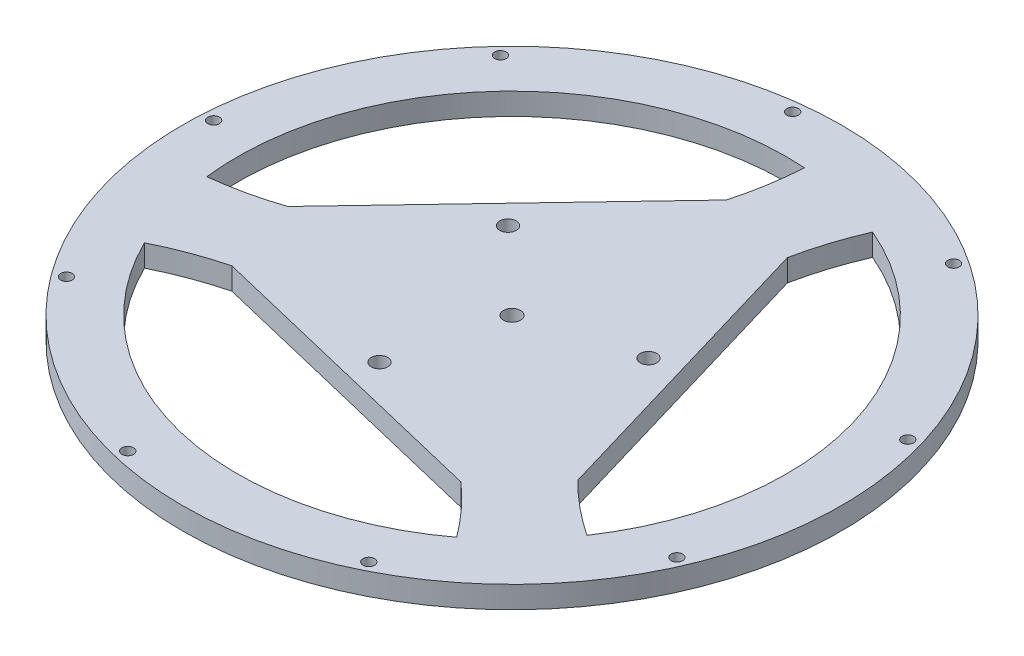
ISO-10303-21;
HEADER;
FILE_DESCRIPTION(('STEP AP214'),'2;1');
FILE_NAME('part.step','',(''),(''),'','','');
FILE_SCHEMA(('AUTOMOTIVE_DESIGN { 1 0 10303 214 1 1 1 1 }'));
ENDSEC;
DATA;
#1=APPLICATION_CONTEXT('core data for automotive mechanical design processes');
#2=APPLICATION_PROTOCOL_DEFINITION('international standard','automotive_design',2000,#1);
#3=PRODUCT_CONTEXT('',#1,'mechanical');
#4=PRODUCT('Part','Part','',(#3));
#5=PRODUCT_RELATED_PRODUCT_CATEGORY('part','',(#4));
#6=PRODUCT_DEFINITION_FORMATION('','',#4);
#7=PRODUCT_DEFINITION_CONTEXT('part definition',#1,'design');
#8=PRODUCT_DEFINITION('design','',#6,#7);
#9=PRODUCT_DEFINITION_SHAPE('','',#8);
#10=(LENGTH_UNIT() NAMED_UNIT(*) SI_UNIT(.MILLI.,.METRE.));
#11=(NAMED_UNIT(*) PLANE_ANGLE_UNIT() SI_UNIT($,.RADIAN.));
#12=(NAMED_UNIT(*) SI_UNIT($,.STERADIAN.) SOLID_ANGLE_UNIT());
#13=UNCERTAINTY_MEASURE_WITH_UNIT(LENGTH_MEASURE(1.E-05),#10,'distance_accuracy_value','');
#14=(GEOMETRIC_REPRESENTATION_CONTEXT(3) GLOBAL_UNCERTAINTY_ASSIGNED_CONTEXT((#13)) GLOBAL_UNIT_ASSIGNED_CONTEXT((#10,
#11,#12)) REPRESENTATION_CONTEXT('',''));
#15=CARTESIAN_POINT('',(0.,0.,0.));
#16=DIRECTION('',(0.,0.,1.));
#17=DIRECTION('',(1.,0.,0.));
#18=AXIS2_PLACEMENT_3D('',#15,#16,#17);
#19=CARTESIAN_POINT('',(0.,4.,0.));
#20=DIRECTION('',(0.,1.,0.));
#21=DIRECTION('',(0.,0.,1.));
#22=AXIS2_PLACEMENT_3D('',#19,#20,#21);
#23=PLANE('',#22);
#24=CARTESIAN_POINT('',(-57.8899742574897,4.,-3.5708375022087));
#25=DIRECTION('',(0.,1.,0.));
#26=DIRECTION('',(0.,0.,1.));
#27=AXIS2_PLACEMENT_3D('',#24,#25,#26);
#28=CIRCLE('',#27,1.05293502772648);
#29=CARTESIAN_POINT('',(-57.8899742574897,4.,-2.51790247448222));
#30=VERTEX_POINT('',#29);
#31=EDGE_CURVE('E468',#30,#30,#28,.F.);
#32=ORIENTED_EDGE('',*,*,#31,.T.);
#33=EDGE_LOOP('',(#32));
#34=FACE_BOUND('',#33,.T.);
#35=CARTESIAN_POINT('',(0.,4.,0.));
#36=DIRECTION('',(0.,1.,0.));
#37=DIRECTION('',(0.,0.,1.));
#38=AXIS2_PLACEMENT_3D('',#35,#36,#37);
#39=CIRCLE('',#38,1.55);
#40=CARTESIAN_POINT('',(0.,4.,1.55));
#41=VERTEX_POINT('',#40);
#42=EDGE_CURVE('E302',#41,#41,#39,.F.);
#43=ORIENTED_EDGE('',*,*,#42,.T.);
#44=EDGE_LOOP('',(#43));
#45=FACE_BOUND('',#44,.T.);
#46=CARTESIAN_POINT('',(53.1774832729495,4.,23.1550269435159));
#47=DIRECTION('',(0.,1.,0.));
#48=DIRECTION('',(0.,0.,1.));
#49=AXIS2_PLACEMENT_3D('',#46,#47,#48);
#50=CIRCLE('',#49,1.05293502772553);
#51=CARTESIAN_POINT('',(53.1774832729495,4.,24.2079619712414));
#52=VERTEX_POINT('',#51);
#53=EDGE_CURVE('E312',#52,#52,#50,.T.);
#54=ORIENTED_EDGE('',*,*,#53,.F.);
#55=EDGE_LOOP('',(#54));
#56=FACE_BOUND('',#55,.T.);
#57=CARTESIAN_POINT('',(-13.5690769919208,4.,56.3904260454485));
#58=DIRECTION('',(0.,1.,0.));
#59=DIRECTION('',(0.,0.,1.));
#60=AXIS2_PLACEMENT_3D('',#57,#58,#59);
#61=CIRCLE('',#60,1.05293502772525);
#62=CARTESIAN_POINT('',(-13.5690769919208,4.,57.4433610731738));
#63=VERTEX_POINT('',#62);
#64=EDGE_CURVE('E324',#63,#63,#61,.T.);
#65=ORIENTED_EDGE('',*,*,#64,.F.);
#66=EDGE_LOOP('',(#65));
#67=FACE_BOUND('',#66,.T.);
#68=CARTESIAN_POINT('',(-6.53590007807735,4.,-57.6305648954562));
#69=DIRECTION('',(0.,1.,0.));
#70=DIRECTION('',(0.,0.,1.));
#71=AXIS2_PLACEMENT_3D('',#68,#69,#70);
#72=CIRCLE('',#71,1.05293502772648);
#73=CARTESIAN_POINT('',(-6.53590007807735,4.,-56.5776298677297));
#74=VERTEX_POINT('',#73);
#75=EDGE_CURVE('E336',#74,#74,#72,.T.);
#76=ORIENTED_EDGE('',*,*,#75,.F.);
#77=EDGE_LOOP('',(#76));
#78=FACE_BOUND('',#77,.T.);
#79=CARTESIAN_POINT('',(55.6200799815454,4.,-16.4440476418153));
#80=DIRECTION('',(0.,1.,0.));
#81=DIRECTION('',(0.,0.,1.));
#82=AXIS2_PLACEMENT_3D('',#79,#80,#81);
#83=CIRCLE('',#82,1.05293502772614);
#84=CARTESIAN_POINT('',(55.6200799815454,4.,-15.3911126140892));
#85=VERTEX_POINT('',#84);
#86=EDGE_CURVE('E348',#85,#85,#83,.T.);
#87=ORIENTED_EDGE('',*,*,#86,.F.);
#88=EDGE_LOOP('',(#87));
#89=FACE_BOUND('',#88,.T.);
#90=CARTESIAN_POINT('',(-4.67899206617935,4.,19.444974498431));
#91=DIRECTION('',(0.,1.,0.));
#92=DIRECTION('',(0.,0.,1.));
#93=AXIS2_PLACEMENT_3D('',#90,#91,#92);
#94=CIRCLE('',#93,1.5);
#95=CARTESIAN_POINT('',(-4.67899206617935,4.,20.944974498431));
#96=VERTEX_POINT('',#95);
#97=EDGE_CURVE('E360',#96,#96,#94,.T.);
#98=ORIENTED_EDGE('',*,*,#97,.F.);
#99=EDGE_LOOP('',(#98));
#100=FACE_BOUND('',#99,.T.);
#101=CARTESIAN_POINT('',(0.,4.,0.));
#102=DIRECTION('',(0.,1.,0.));
#103=DIRECTION('',(0.,0.,1.));
#104=AXIS2_PLACEMENT_3D('',#101,#102,#103);
#105=CIRCLE('',#104,50.);
#106=CARTESIAN_POINT('',(41.5155711519758,4.,27.8649843338415));
#107=VERTEX_POINT('',#106);
#108=CARTESIAN_POINT('',(19.6892098874326,4.,-45.9601459311067));
#109=VERTEX_POINT('',#108);
#110=EDGE_CURVE('E406',#107,#109,#105,.T.);
#111=ORIENTED_EDGE('',*,*,#110,.F.);
#112=CARTESIAN_POINT('',(74.7395128137497,4.,-22.0966979882647));
#113=DIRECTION('',(0.,1.,0.));
#114=DIRECTION('',(0.,0.,1.));
#115=AXIS2_PLACEMENT_3D('',#112,#113,#114);
#116=CIRCLE('',#115,60.);
#117=CARTESIAN_POINT('',(31.9813255757251,4.,19.995313416728));
#118=VERTEX_POINT('',#117);
#119=EDGE_CURVE('E404',#118,#107,#116,.T.);
#120=ORIENTED_EDGE('',*,*,#119,.F.);
#121=DIRECTION('',(-0.28351806278993,0.,-0.958966896233569));
#122=VECTOR('',#121,1.);
#123=CARTESIAN_POINT('',(31.9813255757251,4.,19.995313416728));
#124=LINE('',#123,#122);
#125=CARTESIAN_POINT('',(15.967019235954,4.,-34.1712165562232));
#126=VERTEX_POINT('',#125);
#127=EDGE_CURVE('E412',#118,#126,#124,.T.);
#128=ORIENTED_EDGE('',*,*,#127,.T.);
#129=CARTESIAN_POINT('',(74.7395128137497,4.,-22.0966979882647));
#130=DIRECTION('',(0.,1.,0.));
#131=DIRECTION('',(0.,0.,1.));
#132=AXIS2_PLACEMENT_3D('',#129,#130,#131);
#133=CIRCLE('',#132,60.);
#134=EDGE_CURVE('E409',#109,#126,#133,.T.);
#135=ORIENTED_EDGE('',*,*,#134,.F.);
#136=EDGE_LOOP('',(#111,#120,#128,#135));
#137=FACE_BOUND('',#136,.T.);
#138=CARTESIAN_POINT('',(-14.5003458584922,4.,-13.7746132426325));
#139=DIRECTION('',(0.,1.,0.));
#140=DIRECTION('',(0.,0.,1.));
#141=AXIS2_PLACEMENT_3D('',#138,#139,#140);
#142=CIRCLE('',#141,1.5);
#143=CARTESIAN_POINT('',(-14.5003458584922,4.,-12.2746132426325));
#144=VERTEX_POINT('',#143);
#145=EDGE_CURVE('E436',#144,#144,#142,.T.);
#146=ORIENTED_EDGE('',*,*,#145,.F.);
#147=EDGE_LOOP('',(#146));
#148=FACE_BOUND('',#147,.T.);
#149=CARTESIAN_POINT('',(0.,4.,0.));
#150=DIRECTION('',(0.,1.,0.));
#151=DIRECTION('',(0.,0.,1.));
#152=AXIS2_PLACEMENT_3D('',#149,#150,#151);
#153=CIRCLE('',#152,60.);
#154=CARTESIAN_POINT('',(0.,4.,60.));
#155=VERTEX_POINT('',#154);
#156=EDGE_CURVE('E12',#155,#155,#153,.T.);
#157=ORIENTED_EDGE('',*,*,#156,.T.);
#158=EDGE_LOOP('',(#157));
#159=FACE_BOUND('',#158,.T.);
#160=CARTESIAN_POINT('',(-42.0510029896274,4.,-39.9463784036344));
#161=DIRECTION('',(0.,1.,0.));
#162=DIRECTION('',(0.,0.,1.));
#163=AXIS2_PLACEMENT_3D('',#160,#161,#162);
#164=CIRCLE('',#163,1.05293502772648);
#165=CARTESIAN_POINT('',(-42.0510029896274,4.,-38.8934433759079));
#166=VERTEX_POINT('',#165);
#167=EDGE_CURVE('E398',#166,#166,#164,.T.);
#168=ORIENTED_EDGE('',*,*,#167,.F.);
#169=EDGE_LOOP('',(#168));
#170=FACE_BOUND('',#169,.T.);
#171=CARTESIAN_POINT('',(0.,4.,0.));
#172=DIRECTION('',(0.,1.,0.));
#173=DIRECTION('',(0.,0.,1.));
#174=AXIS2_PLACEMENT_3D('',#171,#172,#173);
#175=CIRCLE('',#174,50.);
#176=CARTESIAN_POINT('',(-44.8895698851501,4.,22.0210471033105));
#177=VERTEX_POINT('',#176);
#178=CARTESIAN_POINT('',(29.9580489942619,4.,40.0314289085139));
#179=VERTEX_POINT('',#178);
#180=EDGE_CURVE('E368',#177,#179,#175,.T.);
#181=ORIENTED_EDGE('',*,*,#180,.F.);
#182=CARTESIAN_POINT('',(-18.2334546092855,4.,75.774665757312));
#183=DIRECTION('',(0.,1.,0.));
#184=DIRECTION('',(0.,0.,1.));
#185=AXIS2_PLACEMENT_3D('',#182,#183,#184);
#186=CIRCLE('',#185,60.);
#187=CARTESIAN_POINT('',(-33.3071121633809,4.,17.6989836869147));
#188=VERTEX_POINT('',#187);
#189=EDGE_CURVE('E366',#188,#177,#186,.T.);
#190=ORIENTED_EDGE('',*,*,#189,.F.);
#191=DIRECTION('',(0.972248724921551,0.,0.233949603308958));
#192=VECTOR('',#191,1.);
#193=CARTESIAN_POINT('',(-33.3071121633809,4.,17.6989836869147));
#194=LINE('',#193,#192);
#195=CARTESIAN_POINT('',(21.6096319979315,4.,30.9134525591627));
#196=VERTEX_POINT('',#195);
#197=EDGE_CURVE('E374',#188,#196,#194,.T.);
#198=ORIENTED_EDGE('',*,*,#197,.T.);
#199=CARTESIAN_POINT('',(-18.2334546092855,4.,75.774665757312));
#200=DIRECTION('',(0.,1.,0.));
#201=DIRECTION('',(0.,0.,1.));
#202=AXIS2_PLACEMENT_3D('',#199,#200,#201);
#203=CIRCLE('',#202,60.);
#204=EDGE_CURVE('E371',#179,#196,#203,.T.);
#205=ORIENTED_EDGE('',*,*,#204,.F.);
#206=EDGE_LOOP('',(#181,#190,#198,#205));
#207=FACE_BOUND('',#206,.T.);
#208=CARTESIAN_POINT('',(19.1793379246714,4.,-5.67036125579842));
#209=DIRECTION('',(0.,1.,0.));
#210=DIRECTION('',(0.,0.,1.));
#211=AXIS2_PLACEMENT_3D('',#208,#209,#210);
#212=CIRCLE('',#211,1.5);
#213=CARTESIAN_POINT('',(19.1793379246714,4.,-4.17036125579842));
#214=VERTEX_POINT('',#213);
#215=EDGE_CURVE('E354',#214,#214,#212,.T.);
#216=ORIENTED_EDGE('',*,*,#215,.F.);
#217=EDGE_LOOP('',(#216));
#218=FACE_BOUND('',#217,.T.);
#219=CARTESIAN_POINT('',(32.037423118442,4.,-48.3487695803088));
#220=DIRECTION('',(0.,1.,0.));
#221=DIRECTION('',(0.,0.,1.));
#222=AXIS2_PLACEMENT_3D('',#219,#220,#221);
#223=CIRCLE('',#222,1.05293502772665);
#224=CARTESIAN_POINT('',(32.037423118442,4.,-47.2958345525821));
#225=VERTEX_POINT('',#224);
#226=EDGE_CURVE('E342',#225,#225,#223,.T.);
#227=ORIENTED_EDGE('',*,*,#226,.F.);
#228=EDGE_LOOP('',(#227));
#229=FACE_BOUND('',#228,.T.);
#230=CARTESIAN_POINT('',(-46.6415831948744,4.,34.4755379519386));
#231=DIRECTION('',(0.,1.,0.));
#232=DIRECTION('',(0.,0.,1.));
#233=AXIS2_PLACEMENT_3D('',#230,#231,#232);
#234=CIRCLE('',#233,1.05293502772574);
#235=CARTESIAN_POINT('',(-46.6415831948744,4.,35.5284729796644));
#236=VERTEX_POINT('',#235);
#237=EDGE_CURVE('E330',#236,#236,#234,.T.);
#238=ORIENTED_EDGE('',*,*,#237,.F.);
#239=EDGE_LOOP('',(#238));
#240=FACE_BOUND('',#239,.T.);
#241=CARTESIAN_POINT('',(25.8525511390449,4.,51.9196070825162));
#242=DIRECTION('',(0.,1.,0.));
#243=DIRECTION('',(0.,0.,1.));
#244=AXIS2_PLACEMENT_3D('',#241,#242,#243);
#245=CIRCLE('',#244,1.05293502772513);
#246=CARTESIAN_POINT('',(25.8525511390449,4.,52.9725421102413));
#247=VERTEX_POINT('',#246);
#248=EDGE_CURVE('E318',#247,#247,#245,.T.);
#249=ORIENTED_EDGE('',*,*,#248,.F.);
#250=EDGE_LOOP('',(#249));
#251=FACE_BOUND('',#250,.T.);
#252=DIRECTION('',(-0.688730662131619,0.,0.725017292924618));
#253=VECTOR('',#252,1.);
#254=CARTESIAN_POINT('',(-18.1254323231156,4.,-17.2182665532906));
#255=LINE('',#254,#253);
#256=CARTESIAN_POINT('',(1.32578658765488,4.,-37.6942971036422));
#257=VERTEX_POINT('',#256);
#258=CARTESIAN_POINT('',(-37.5766512338855,4.,3.25776399706044));
#259=VERTEX_POINT('',#258);
#260=EDGE_CURVE('E286',#257,#259,#255,.T.);
#261=ORIENTED_EDGE('',*,*,#260,.T.);
#262=CARTESIAN_POINT('',(-56.5060582044648,4.,-53.6779677690472));
#263=DIRECTION('',(0.,1.,0.));
#264=DIRECTION('',(0.,0.,1.));
#265=AXIS2_PLACEMENT_3D('',#262,#263,#264);
#266=CIRCLE('',#265,59.9999999999999);
#267=CARTESIAN_POINT('',(-49.6472588816947,4.,5.92871702259306));
#268=VERTEX_POINT('',#267);
#269=EDGE_CURVE('E296',#268,#259,#266,.T.);
#270=ORIENTED_EDGE('',*,*,#269,.F.);
#271=CARTESIAN_POINT('',(0.,4.,0.));
#272=DIRECTION('',(0.,1.,0.));
#273=DIRECTION('',(0.,0.,1.));
#274=AXIS2_PLACEMENT_3D('',#271,#272,#273);
#275=CIRCLE('',#274,50.);
#276=CARTESIAN_POINT('',(3.37399873317395,4.,-49.8860314371522));
#277=VERTEX_POINT('',#276);
#278=EDGE_CURVE('E294',#277,#268,#275,.T.);
#279=ORIENTED_EDGE('',*,*,#278,.F.);
#280=CARTESIAN_POINT('',(-56.5060582044648,4.,-53.6779677690472));
#281=DIRECTION('',(0.,1.,0.));
#282=DIRECTION('',(0.,0.,1.));
#283=AXIS2_PLACEMENT_3D('',#280,#281,#282);
#284=CIRCLE('',#283,60.);
#285=EDGE_CURVE('E278',#257,#277,#284,.T.);
#286=ORIENTED_EDGE('',*,*,#285,.F.);
#287=EDGE_LOOP('',(#261,#270,#279,#286));
#288=FACE_BOUND('',#287,.T.);
#289=ADVANCED_FACE('F185',(#34,#45,#56,#67,#78,#89,#100,#137,#148,#159,#170,#207,#218,#229,#240,
#251,#288),#23,.T.);
#290=CARTESIAN_POINT('',(0.,0.,0.));
#291=DIRECTION('',(0.,1.,0.));
#292=DIRECTION('',(0.,0.,1.));
#293=AXIS2_PLACEMENT_3D('',#290,#291,#292);
#294=PLANE('',#293);
#295=CARTESIAN_POINT('',(-57.8899742574897,0.,-3.5708375022087));
#296=DIRECTION('',(0.,1.,0.));
#297=DIRECTION('',(0.,0.,1.));
#298=AXIS2_PLACEMENT_3D('',#295,#296,#297);
#299=CIRCLE('',#298,1.05293502772648);
#300=CARTESIAN_POINT('',(-57.8899742574897,0.,-2.51790247448222));
#301=VERTEX_POINT('',#300);
#302=EDGE_CURVE('E721',#301,#301,#299,.T.);
#303=ORIENTED_EDGE('',*,*,#302,.T.);
#304=EDGE_LOOP('',(#303));
#305=FACE_BOUND('',#304,.T.);
#306=CARTESIAN_POINT('',(0.,0.,0.));
#307=DIRECTION('',(0.,1.,0.));
#308=DIRECTION('',(0.,0.,1.));
#309=AXIS2_PLACEMENT_3D('',#306,#307,#308);
#310=CIRCLE('',#309,1.55);
#311=CARTESIAN_POINT('',(0.,0.,1.55));
#312=VERTEX_POINT('',#311);
#313=EDGE_CURVE('E723',#312,#312,#310,.T.);
#314=ORIENTED_EDGE('',*,*,#313,.T.);
#315=EDGE_LOOP('',(#314));
#316=FACE_BOUND('',#315,.T.);
#317=CARTESIAN_POINT('',(-42.0510029896274,0.,-39.9463784036344));
#318=DIRECTION('',(0.,1.,0.));
#319=DIRECTION('',(0.,0.,1.));
#320=AXIS2_PLACEMENT_3D('',#317,#318,#319);
#321=CIRCLE('',#320,1.05293502772648);
#322=CARTESIAN_POINT('',(-42.0510029896274,0.,-38.8934433759079));
#323=VERTEX_POINT('',#322);
#324=EDGE_CURVE('E397',#323,#323,#321,.T.);
#325=ORIENTED_EDGE('',*,*,#324,.T.);
#326=EDGE_LOOP('',(#325));
#327=FACE_BOUND('',#326,.T.);
#328=CARTESIAN_POINT('',(74.7395128137497,0.,-22.0966979882647));
#329=DIRECTION('',(0.,1.,0.));
#330=DIRECTION('',(0.,0.,1.));
#331=AXIS2_PLACEMENT_3D('',#328,#329,#330);
#332=CIRCLE('',#331,60.);
#333=CARTESIAN_POINT('',(31.9813255757251,0.,19.995313416728));
#334=VERTEX_POINT('',#333);
#335=CARTESIAN_POINT('',(41.5155711519758,0.,27.8649843338415));
#336=VERTEX_POINT('',#335);
#337=EDGE_CURVE('E401',#334,#336,#332,.T.);
#338=ORIENTED_EDGE('',*,*,#337,.T.);
#339=CARTESIAN_POINT('',(0.,0.,0.));
#340=DIRECTION('',(0.,1.,0.));
#341=DIRECTION('',(0.,0.,1.));
#342=AXIS2_PLACEMENT_3D('',#339,#340,#341);
#343=CIRCLE('',#342,50.);
#344=CARTESIAN_POINT('',(19.6892098874326,0.,-45.9601459311067));
#345=VERTEX_POINT('',#344);
#346=EDGE_CURVE('E418',#336,#345,#343,.T.);
#347=ORIENTED_EDGE('',*,*,#346,.T.);
#348=CARTESIAN_POINT('',(74.7395128137497,0.,-22.0966979882647));
#349=DIRECTION('',(0.,1.,0.));
#350=DIRECTION('',(0.,0.,1.));
#351=AXIS2_PLACEMENT_3D('',#348,#349,#350);
#352=CIRCLE('',#351,60.);
#353=CARTESIAN_POINT('',(15.967019235954,0.,-34.1712165562232));
#354=VERTEX_POINT('',#353);
#355=EDGE_CURVE('E421',#345,#354,#352,.T.);
#356=ORIENTED_EDGE('',*,*,#355,.T.);
#357=DIRECTION('',(-0.28351806278993,0.,-0.958966896233569));
#358=VECTOR('',#357,1.);
#359=CARTESIAN_POINT('',(31.9813255757251,0.,19.995313416728));
#360=LINE('',#359,#358);
#361=EDGE_CURVE('E407',#334,#354,#360,.T.);
#362=ORIENTED_EDGE('',*,*,#361,.F.);
#363=EDGE_LOOP('',(#338,#347,#356,#362));
#364=FACE_BOUND('',#363,.T.);
#365=CARTESIAN_POINT('',(0.,0.,0.));
#366=DIRECTION('',(0.,1.,0.));
#367=DIRECTION('',(0.,0.,1.));
#368=AXIS2_PLACEMENT_3D('',#365,#366,#367);
#369=CIRCLE('',#368,60.);
#370=CARTESIAN_POINT('',(0.,0.,60.));
#371=VERTEX_POINT('',#370);
#372=EDGE_CURVE('E189',#371,#371,#369,.T.);
#373=ORIENTED_EDGE('',*,*,#372,.F.);
#374=EDGE_LOOP('',(#373));
#375=FACE_BOUND('',#374,.T.);
#376=CARTESIAN_POINT('',(-14.5003458584922,0.,-13.7746132426325));
#377=DIRECTION('',(0.,1.,0.));
#378=DIRECTION('',(0.,0.,1.));
#379=AXIS2_PLACEMENT_3D('',#376,#377,#378);
#380=CIRCLE('',#379,1.5);
#381=CARTESIAN_POINT('',(-14.5003458584922,0.,-12.2746132426325));
#382=VERTEX_POINT('',#381);
#383=EDGE_CURVE('E435',#382,#382,#380,.T.);
#384=ORIENTED_EDGE('',*,*,#383,.T.);
#385=EDGE_LOOP('',(#384));
#386=FACE_BOUND('',#385,.T.);
#387=CARTESIAN_POINT('',(-18.2334546092855,0.,75.774665757312));
#388=DIRECTION('',(0.,1.,0.));
#389=DIRECTION('',(0.,0.,1.));
#390=AXIS2_PLACEMENT_3D('',#387,#388,#389);
#391=CIRCLE('',#390,60.);
#392=CARTESIAN_POINT('',(-33.3071121633809,0.,17.6989836869147));
#393=VERTEX_POINT('',#392);
#394=CARTESIAN_POINT('',(-44.8895698851501,0.,22.0210471033105));
#395=VERTEX_POINT('',#394);
#396=EDGE_CURVE('E363',#393,#395,#391,.T.);
#397=ORIENTED_EDGE('',*,*,#396,.T.);
#398=CARTESIAN_POINT('',(0.,0.,0.));
#399=DIRECTION('',(0.,1.,0.));
#400=DIRECTION('',(0.,0.,1.));
#401=AXIS2_PLACEMENT_3D('',#398,#399,#400);
#402=CIRCLE('',#401,50.);
#403=CARTESIAN_POINT('',(29.9580489942619,0.,40.0314289085139));
#404=VERTEX_POINT('',#403);
#405=EDGE_CURVE('E380',#395,#404,#402,.T.);
#406=ORIENTED_EDGE('',*,*,#405,.T.);
#407=CARTESIAN_POINT('',(-18.2334546092855,0.,75.774665757312));
#408=DIRECTION('',(0.,1.,0.));
#409=DIRECTION('',(0.,0.,1.));
#410=AXIS2_PLACEMENT_3D('',#407,#408,#409);
#411=CIRCLE('',#410,60.);
#412=CARTESIAN_POINT('',(21.6096319979315,0.,30.9134525591627));
#413=VERTEX_POINT('',#412);
#414=EDGE_CURVE('E383',#404,#413,#411,.T.);
#415=ORIENTED_EDGE('',*,*,#414,.T.);
#416=DIRECTION('',(0.972248724921551,0.,0.233949603308958));
#417=VECTOR('',#416,1.);
#418=CARTESIAN_POINT('',(-33.3071121633809,0.,17.6989836869147));
#419=LINE('',#418,#417);
#420=EDGE_CURVE('E369',#393,#413,#419,.T.);
#421=ORIENTED_EDGE('',*,*,#420,.F.);
#422=EDGE_LOOP('',(#397,#406,#415,#421));
#423=FACE_BOUND('',#422,.T.);
#424=CARTESIAN_POINT('',(-4.67899206617935,0.,19.444974498431));
#425=DIRECTION('',(0.,1.,0.));
#426=DIRECTION('',(0.,0.,1.));
#427=AXIS2_PLACEMENT_3D('',#424,#425,#426);
#428=CIRCLE('',#427,1.5);
#429=CARTESIAN_POINT('',(-4.67899206617935,0.,20.944974498431));
#430=VERTEX_POINT('',#429);
#431=EDGE_CURVE('E357',#430,#430,#428,.T.);
#432=ORIENTED_EDGE('',*,*,#431,.T.);
#433=EDGE_LOOP('',(#432));
#434=FACE_BOUND('',#433,.T.);
#435=CARTESIAN_POINT('',(19.1793379246714,0.,-5.67036125579842));
#436=DIRECTION('',(0.,1.,0.));
#437=DIRECTION('',(0.,0.,1.));
#438=AXIS2_PLACEMENT_3D('',#435,#436,#437);
#439=CIRCLE('',#438,1.5);
#440=CARTESIAN_POINT('',(19.1793379246714,0.,-4.17036125579842));
#441=VERTEX_POINT('',#440);
#442=EDGE_CURVE('E351',#441,#441,#439,.T.);
#443=ORIENTED_EDGE('',*,*,#442,.T.);
#444=EDGE_LOOP('',(#443));
#445=FACE_BOUND('',#444,.T.);
#446=CARTESIAN_POINT('',(55.6200799815454,0.,-16.4440476418153));
#447=DIRECTION('',(0.,1.,0.));
#448=DIRECTION('',(0.,0.,1.));
#449=AXIS2_PLACEMENT_3D('',#446,#447,#448);
#450=CIRCLE('',#449,1.05293502772614);
#451=CARTESIAN_POINT('',(55.6200799815454,0.,-15.3911126140892));
#452=VERTEX_POINT('',#451);
#453=EDGE_CURVE('E345',#452,#452,#450,.T.);
#454=ORIENTED_EDGE('',*,*,#453,.T.);
#455=EDGE_LOOP('',(#454));
#456=FACE_BOUND('',#455,.T.);
#457=CARTESIAN_POINT('',(32.037423118442,0.,-48.3487695803088));
#458=DIRECTION('',(0.,1.,0.));
#459=DIRECTION('',(0.,0.,1.));
#460=AXIS2_PLACEMENT_3D('',#457,#458,#459);
#461=CIRCLE('',#460,1.05293502772665);
#462=CARTESIAN_POINT('',(32.037423118442,0.,-47.2958345525821));
#463=VERTEX_POINT('',#462);
#464=EDGE_CURVE('E339',#463,#463,#461,.T.);
#465=ORIENTED_EDGE('',*,*,#464,.T.);
#466=EDGE_LOOP('',(#465));
#467=FACE_BOUND('',#466,.T.);
#468=CARTESIAN_POINT('',(-6.53590007807735,0.,-57.6305648954562));
#469=DIRECTION('',(0.,1.,0.));
#470=DIRECTION('',(0.,0.,1.));
#471=AXIS2_PLACEMENT_3D('',#468,#469,#470);
#472=CIRCLE('',#471,1.05293502772648);
#473=CARTESIAN_POINT('',(-6.53590007807735,0.,-56.5776298677297));
#474=VERTEX_POINT('',#473);
#475=EDGE_CURVE('E333',#474,#474,#472,.T.);
#476=ORIENTED_EDGE('',*,*,#475,.T.);
#477=EDGE_LOOP('',(#476));
#478=FACE_BOUND('',#477,.T.);
#479=CARTESIAN_POINT('',(-46.6415831948744,0.,34.4755379519386));
#480=DIRECTION('',(0.,1.,0.));
#481=DIRECTION('',(0.,0.,1.));
#482=AXIS2_PLACEMENT_3D('',#479,#480,#481);
#483=CIRCLE('',#482,1.05293502772574);
#484=CARTESIAN_POINT('',(-46.6415831948744,0.,35.5284729796644));
#485=VERTEX_POINT('',#484);
#486=EDGE_CURVE('E327',#485,#485,#483,.T.);
#487=ORIENTED_EDGE('',*,*,#486,.T.);
#488=EDGE_LOOP('',(#487));
#489=FACE_BOUND('',#488,.T.);
#490=CARTESIAN_POINT('',(-13.5690769919208,0.,56.3904260454485));
#491=DIRECTION('',(0.,1.,0.));
#492=DIRECTION('',(0.,0.,1.));
#493=AXIS2_PLACEMENT_3D('',#490,#491,#492);
#494=CIRCLE('',#493,1.05293502772525);
#495=CARTESIAN_POINT('',(-13.5690769919208,0.,57.4433610731738));
#496=VERTEX_POINT('',#495);
#497=EDGE_CURVE('E321',#496,#496,#494,.T.);
#498=ORIENTED_EDGE('',*,*,#497,.T.);
#499=EDGE_LOOP('',(#498));
#500=FACE_BOUND('',#499,.T.);
#501=CARTESIAN_POINT('',(25.8525511390449,0.,51.9196070825162));
#502=DIRECTION('',(0.,1.,0.));
#503=DIRECTION('',(0.,0.,1.));
#504=AXIS2_PLACEMENT_3D('',#501,#502,#503);
#505=CIRCLE('',#504,1.05293502772513);
#506=CARTESIAN_POINT('',(25.8525511390449,0.,52.9725421102413));
#507=VERTEX_POINT('',#506);
#508=EDGE_CURVE('E315',#507,#507,#505,.T.);
#509=ORIENTED_EDGE('',*,*,#508,.T.);
#510=EDGE_LOOP('',(#509));
#511=FACE_BOUND('',#510,.T.);
#512=CARTESIAN_POINT('',(53.1774832729495,0.,23.1550269435159));
#513=DIRECTION('',(0.,1.,0.));
#514=DIRECTION('',(0.,0.,1.));
#515=AXIS2_PLACEMENT_3D('',#512,#513,#514);
#516=CIRCLE('',#515,1.05293502772553);
#517=CARTESIAN_POINT('',(53.1774832729495,0.,24.2079619712414));
#518=VERTEX_POINT('',#517);
#519=EDGE_CURVE('E282',#518,#518,#516,.T.);
#520=ORIENTED_EDGE('',*,*,#519,.T.);
#521=EDGE_LOOP('',(#520));
#522=FACE_BOUND('',#521,.T.);
#523=CARTESIAN_POINT('',(-56.5060582044648,0.,-53.6779677690472));
#524=DIRECTION('',(0.,1.,0.));
#525=DIRECTION('',(0.,0.,1.));
#526=AXIS2_PLACEMENT_3D('',#523,#524,#525);
#527=CIRCLE('',#526,59.9999999999999);
#528=CARTESIAN_POINT('',(-49.6472588816947,0.,5.92871702259318));
#529=VERTEX_POINT('',#528);
#530=CARTESIAN_POINT('',(-37.5766512338854,0.,3.25776399706055));
#531=VERTEX_POINT('',#530);
#532=EDGE_CURVE('E291',#529,#531,#527,.T.);
#533=ORIENTED_EDGE('',*,*,#532,.T.);
#534=DIRECTION('',(-0.688730662131619,0.,0.725017292924618));
#535=VECTOR('',#534,1.);
#536=CARTESIAN_POINT('',(-18.1254323231156,0.,-17.2182665532906));
#537=LINE('',#536,#535);
#538=CARTESIAN_POINT('',(1.32578658765488,0.,-37.6942971036422));
#539=VERTEX_POINT('',#538);
#540=EDGE_CURVE('E208',#539,#531,#537,.T.);
#541=ORIENTED_EDGE('',*,*,#540,.F.);
#542=CARTESIAN_POINT('',(-56.5060582044648,0.,-53.6779677690472));
#543=DIRECTION('',(0.,1.,0.));
#544=DIRECTION('',(0.,0.,1.));
#545=AXIS2_PLACEMENT_3D('',#542,#543,#544);
#546=CIRCLE('',#545,60.);
#547=CARTESIAN_POINT('',(3.37399873317395,0.,-49.8860314371522));
#548=VERTEX_POINT('',#547);
#549=EDGE_CURVE('E281',#539,#548,#546,.T.);
#550=ORIENTED_EDGE('',*,*,#549,.T.);
#551=CARTESIAN_POINT('',(0.,0.,0.));
#552=DIRECTION('',(0.,1.,0.));
#553=DIRECTION('',(0.,0.,1.));
#554=AXIS2_PLACEMENT_3D('',#551,#552,#553);
#555=CIRCLE('',#554,50.);
#556=EDGE_CURVE('E304',#548,#529,#555,.T.);
#557=ORIENTED_EDGE('',*,*,#556,.T.);
#558=EDGE_LOOP('',(#533,#541,#550,#557));
#559=FACE_BOUND('',#558,.T.);
#560=ADVANCED_FACE('F442',(#305,#316,#327,#364,#375,#386,#423,#434,#445,#456,#467,#478,#489,
#500,#511,#522,#559),#294,.F.);
#561=CARTESIAN_POINT('',(0.,4.,0.));
#562=DIRECTION('',(0.,-1.,0.));
#563=DIRECTION('',(0.,0.,-1.));
#564=AXIS2_PLACEMENT_3D('',#561,#562,#563);
#565=CYLINDRICAL_SURFACE('',#564,60.);
#566=ORIENTED_EDGE('',*,*,#156,.F.);
#567=EDGE_LOOP('',(#566));
#568=FACE_BOUND('',#567,.T.);
#569=ORIENTED_EDGE('',*,*,#372,.T.);
#570=EDGE_LOOP('',(#569));
#571=FACE_BOUND('',#570,.T.);
#572=ADVANCED_FACE('F187',(#568,#571),#565,.T.);
#573=CARTESIAN_POINT('',(-14.5003458584922,4.,-13.7746132426325));
#574=DIRECTION('',(0.,-1.,0.));
#575=DIRECTION('',(0.,0.,-1.));
#576=AXIS2_PLACEMENT_3D('',#573,#574,#575);
#577=CYLINDRICAL_SURFACE('',#576,1.5);
#578=ORIENTED_EDGE('',*,*,#145,.T.);
#579=EDGE_LOOP('',(#578));
#580=FACE_BOUND('',#579,.T.);
#581=ORIENTED_EDGE('',*,*,#383,.F.);
#582=EDGE_LOOP('',(#581));
#583=FACE_BOUND('',#582,.T.);
#584=ADVANCED_FACE('F445',(#580,#583),#577,.F.);
#585=CARTESIAN_POINT('',(74.7395128137497,4.,-22.0966979882647));
#586=DIRECTION('',(0.,-1.,0.));
#587=DIRECTION('',(0.,0.,-1.));
#588=AXIS2_PLACEMENT_3D('',#585,#586,#587);
#589=CYLINDRICAL_SURFACE('',#588,60.);
#590=ORIENTED_EDGE('',*,*,#337,.F.);
#591=DIRECTION('',(0.,-1.,0.));
#592=VECTOR('',#591,1.);
#593=CARTESIAN_POINT('',(31.9813255757251,4.,19.995313416728));
#594=LINE('',#593,#592);
#595=EDGE_CURVE('E415',#118,#334,#594,.T.);
#596=ORIENTED_EDGE('',*,*,#595,.F.);
#597=ORIENTED_EDGE('',*,*,#119,.T.);
#598=DIRECTION('',(0.,-1.,0.));
#599=VECTOR('',#598,1.);
#600=CARTESIAN_POINT('',(41.5155711519758,4.,27.8649843338415));
#601=LINE('',#600,#599);
#602=EDGE_CURVE('E432',#107,#336,#601,.T.);
#603=ORIENTED_EDGE('',*,*,#602,.T.);
#604=EDGE_LOOP('',(#590,#596,#597,#603));
#605=FACE_BOUND('',#604,.T.);
#606=ADVANCED_FACE('F447',(#605),#589,.F.);
#607=CARTESIAN_POINT('',(0.,4.,0.));
#608=DIRECTION('',(0.,-1.,0.));
#609=DIRECTION('',(0.,0.,-1.));
#610=AXIS2_PLACEMENT_3D('',#607,#608,#609);
#611=CYLINDRICAL_SURFACE('',#610,50.);
#612=ORIENTED_EDGE('',*,*,#346,.F.);
#613=ORIENTED_EDGE('',*,*,#602,.F.);
#614=ORIENTED_EDGE('',*,*,#110,.T.);
#615=DIRECTION('',(0.,-1.,0.));
#616=VECTOR('',#615,1.);
#617=CARTESIAN_POINT('',(19.6892098874326,4.,-45.9601459311067));
#618=LINE('',#617,#616);
#619=EDGE_CURVE('E430',#109,#345,#618,.T.);
#620=ORIENTED_EDGE('',*,*,#619,.T.);
#621=EDGE_LOOP('',(#612,#613,#614,#620));
#622=FACE_BOUND('',#621,.T.);
#623=ADVANCED_FACE('F454',(#622),#611,.F.);
#624=CARTESIAN_POINT('',(74.7395128137497,4.,-22.0966979882647));
#625=DIRECTION('',(0.,-1.,0.));
#626=DIRECTION('',(0.,0.,-1.));
#627=AXIS2_PLACEMENT_3D('',#624,#625,#626);
#628=CYLINDRICAL_SURFACE('',#627,60.);
#629=ORIENTED_EDGE('',*,*,#355,.F.);
#630=ORIENTED_EDGE('',*,*,#619,.F.);
#631=ORIENTED_EDGE('',*,*,#134,.T.);
#632=DIRECTION('',(0.,-1.,0.));
#633=VECTOR('',#632,1.);
#634=CARTESIAN_POINT('',(15.967019235954,4.,-34.1712165562232));
#635=LINE('',#634,#633);
#636=EDGE_CURVE('E428',#126,#354,#635,.T.);
#637=ORIENTED_EDGE('',*,*,#636,.T.);
#638=EDGE_LOOP('',(#629,#630,#631,#637));
#639=FACE_BOUND('',#638,.T.);
#640=ADVANCED_FACE('F589',(#639),#628,.F.);
#641=CARTESIAN_POINT('',(31.9813255757251,4.,19.995313416728));
#642=DIRECTION('',(-0.958966896233569,0.,0.28351806278993));
#643=DIRECTION('',(0.28351806278993,0.,0.958966896233569));
#644=AXIS2_PLACEMENT_3D('',#641,#642,#643);
#645=PLANE('',#644);
#646=ORIENTED_EDGE('',*,*,#361,.T.);
#647=ORIENTED_EDGE('',*,*,#636,.F.);
#648=ORIENTED_EDGE('',*,*,#127,.F.);
#649=ORIENTED_EDGE('',*,*,#595,.T.);
#650=EDGE_LOOP('',(#646,#647,#648,#649));
#651=FACE_BOUND('',#650,.T.);
#652=ADVANCED_FACE('F585',(#651),#645,.F.);
#653=CARTESIAN_POINT('',(-42.0510029896274,4.,-39.9463784036344));
#654=DIRECTION('',(0.,-1.,0.));
#655=DIRECTION('',(0.,0.,-1.));
#656=AXIS2_PLACEMENT_3D('',#653,#654,#655);
#657=CYLINDRICAL_SURFACE('',#656,1.05293502772648);
#658=ORIENTED_EDGE('',*,*,#167,.T.);
#659=EDGE_LOOP('',(#658));
#660=FACE_BOUND('',#659,.T.);
#661=ORIENTED_EDGE('',*,*,#324,.F.);
#662=EDGE_LOOP('',(#661));
#663=FACE_BOUND('',#662,.T.);
#664=ADVANCED_FACE('F581',(#660,#663),#657,.F.);
#665=CARTESIAN_POINT('',(-18.2334546092855,4.,75.774665757312));
#666=DIRECTION('',(0.,-1.,0.));
#667=DIRECTION('',(0.,0.,-1.));
#668=AXIS2_PLACEMENT_3D('',#665,#666,#667);
#669=CYLINDRICAL_SURFACE('',#668,60.);
#670=ORIENTED_EDGE('',*,*,#396,.F.);
#671=DIRECTION('',(0.,-1.,0.));
#672=VECTOR('',#671,1.);
#673=CARTESIAN_POINT('',(-33.3071121633809,4.,17.6989836869147));
#674=LINE('',#673,#672);
#675=EDGE_CURVE('E377',#188,#393,#674,.T.);
#676=ORIENTED_EDGE('',*,*,#675,.F.);
#677=ORIENTED_EDGE('',*,*,#189,.T.);
#678=DIRECTION('',(0.,-1.,0.));
#679=VECTOR('',#678,1.);
#680=CARTESIAN_POINT('',(-44.8895698851501,4.,22.0210471033105));
#681=LINE('',#680,#679);
#682=EDGE_CURVE('E394',#177,#395,#681,.T.);
#683=ORIENTED_EDGE('',*,*,#682,.T.);
#684=EDGE_LOOP('',(#670,#676,#677,#683));
#685=FACE_BOUND('',#684,.T.);
#686=ADVANCED_FACE('F577',(#685),#669,.F.);
#687=CARTESIAN_POINT('',(0.,4.,0.));
#688=DIRECTION('',(0.,-1.,0.));
#689=DIRECTION('',(0.,0.,-1.));
#690=AXIS2_PLACEMENT_3D('',#687,#688,#689);
#691=CYLINDRICAL_SURFACE('',#690,50.);
#692=ORIENTED_EDGE('',*,*,#405,.F.);
#693=ORIENTED_EDGE('',*,*,#682,.F.);
#694=ORIENTED_EDGE('',*,*,#180,.T.);
#695=DIRECTION('',(0.,-1.,0.));
#696=VECTOR('',#695,1.);
#697=CARTESIAN_POINT('',(29.9580489942619,4.,40.0314289085139));
#698=LINE('',#697,#696);
#699=EDGE_CURVE('E392',#179,#404,#698,.T.);
#700=ORIENTED_EDGE('',*,*,#699,.T.);
#701=EDGE_LOOP('',(#692,#693,#694,#700));
#702=FACE_BOUND('',#701,.T.);
#703=ADVANCED_FACE('F573',(#702),#691,.F.);
#704=CARTESIAN_POINT('',(-18.2334546092855,4.,75.774665757312));
#705=DIRECTION('',(0.,-1.,0.));
#706=DIRECTION('',(0.,0.,-1.));
#707=AXIS2_PLACEMENT_3D('',#704,#705,#706);
#708=CYLINDRICAL_SURFACE('',#707,60.);
#709=ORIENTED_EDGE('',*,*,#414,.F.);
#710=ORIENTED_EDGE('',*,*,#699,.F.);
#711=ORIENTED_EDGE('',*,*,#204,.T.);
#712=DIRECTION('',(0.,-1.,0.));
#713=VECTOR('',#712,1.);
#714=CARTESIAN_POINT('',(21.6096319979315,4.,30.9134525591627));
#715=LINE('',#714,#713);
#716=EDGE_CURVE('E390',#196,#413,#715,.T.);
#717=ORIENTED_EDGE('',*,*,#716,.T.);
#718=EDGE_LOOP('',(#709,#710,#711,#717));
#719=FACE_BOUND('',#718,.T.);
#720=ADVANCED_FACE('F569',(#719),#708,.F.);
#721=CARTESIAN_POINT('',(-33.3071121633809,4.,17.6989836869147));
#722=DIRECTION('',(0.233949603308958,0.,-0.972248724921551));
#723=DIRECTION('',(-0.972248724921551,0.,-0.233949603308958));
#724=AXIS2_PLACEMENT_3D('',#721,#722,#723);
#725=PLANE('',#724);
#726=ORIENTED_EDGE('',*,*,#420,.T.);
#727=ORIENTED_EDGE('',*,*,#716,.F.);
#728=ORIENTED_EDGE('',*,*,#197,.F.);
#729=ORIENTED_EDGE('',*,*,#675,.T.);
#730=EDGE_LOOP('',(#726,#727,#728,#729));
#731=FACE_BOUND('',#730,.T.);
#732=ADVANCED_FACE('F565',(#731),#725,.F.);
#733=CARTESIAN_POINT('',(-4.67899206617935,4.,19.444974498431));
#734=DIRECTION('',(0.,-1.,0.));
#735=DIRECTION('',(0.,0.,-1.));
#736=AXIS2_PLACEMENT_3D('',#733,#734,#735);
#737=CYLINDRICAL_SURFACE('',#736,1.5);
#738=ORIENTED_EDGE('',*,*,#97,.T.);
#739=EDGE_LOOP('',(#738));
#740=FACE_BOUND('',#739,.T.);
#741=ORIENTED_EDGE('',*,*,#431,.F.);
#742=EDGE_LOOP('',(#741));
#743=FACE_BOUND('',#742,.T.);
#744=ADVANCED_FACE('F561',(#740,#743),#737,.F.);
#745=CARTESIAN_POINT('',(19.1793379246714,4.,-5.67036125579842));
#746=DIRECTION('',(0.,-1.,0.));
#747=DIRECTION('',(0.,0.,-1.));
#748=AXIS2_PLACEMENT_3D('',#745,#746,#747);
#749=CYLINDRICAL_SURFACE('',#748,1.5);
#750=ORIENTED_EDGE('',*,*,#215,.T.);
#751=EDGE_LOOP('',(#750));
#752=FACE_BOUND('',#751,.T.);
#753=ORIENTED_EDGE('',*,*,#442,.F.);
#754=EDGE_LOOP('',(#753));
#755=FACE_BOUND('',#754,.T.);
#756=ADVANCED_FACE('F557',(#752,#755),#749,.F.);
#757=CARTESIAN_POINT('',(55.6200799815454,4.,-16.4440476418153));
#758=DIRECTION('',(0.,-1.,0.));
#759=DIRECTION('',(0.,0.,-1.));
#760=AXIS2_PLACEMENT_3D('',#757,#758,#759);
#761=CYLINDRICAL_SURFACE('',#760,1.05293502772614);
#762=ORIENTED_EDGE('',*,*,#86,.T.);
#763=EDGE_LOOP('',(#762));
#764=FACE_BOUND('',#763,.T.);
#765=ORIENTED_EDGE('',*,*,#453,.F.);
#766=EDGE_LOOP('',(#765));
#767=FACE_BOUND('',#766,.T.);
#768=ADVANCED_FACE('F553',(#764,#767),#761,.F.);
#769=CARTESIAN_POINT('',(32.037423118442,4.,-48.3487695803088));
#770=DIRECTION('',(0.,-1.,0.));
#771=DIRECTION('',(0.,0.,-1.));
#772=AXIS2_PLACEMENT_3D('',#769,#770,#771);
#773=CYLINDRICAL_SURFACE('',#772,1.05293502772665);
#774=ORIENTED_EDGE('',*,*,#226,.T.);
#775=EDGE_LOOP('',(#774));
#776=FACE_BOUND('',#775,.T.);
#777=ORIENTED_EDGE('',*,*,#464,.F.);
#778=EDGE_LOOP('',(#777));
#779=FACE_BOUND('',#778,.T.);
#780=ADVANCED_FACE('F549',(#776,#779),#773,.F.);
#781=CARTESIAN_POINT('',(-6.53590007807735,4.,-57.6305648954562));
#782=DIRECTION('',(0.,-1.,0.));
#783=DIRECTION('',(0.,0.,-1.));
#784=AXIS2_PLACEMENT_3D('',#781,#782,#783);
#785=CYLINDRICAL_SURFACE('',#784,1.05293502772648);
#786=ORIENTED_EDGE('',*,*,#75,.T.);
#787=EDGE_LOOP('',(#786));
#788=FACE_BOUND('',#787,.T.);
#789=ORIENTED_EDGE('',*,*,#475,.F.);
#790=EDGE_LOOP('',(#789));
#791=FACE_BOUND('',#790,.T.);
#792=ADVANCED_FACE('F545',(#788,#791),#785,.F.);
#793=CARTESIAN_POINT('',(-46.6415831948744,4.,34.4755379519386));
#794=DIRECTION('',(0.,-1.,0.));
#795=DIRECTION('',(0.,0.,-1.));
#796=AXIS2_PLACEMENT_3D('',#793,#794,#795);
#797=CYLINDRICAL_SURFACE('',#796,1.05293502772574);
#798=ORIENTED_EDGE('',*,*,#237,.T.);
#799=EDGE_LOOP('',(#798));
#800=FACE_BOUND('',#799,.T.);
#801=ORIENTED_EDGE('',*,*,#486,.F.);
#802=EDGE_LOOP('',(#801));
#803=FACE_BOUND('',#802,.T.);
#804=ADVANCED_FACE('F541',(#800,#803),#797,.F.);
#805=CARTESIAN_POINT('',(-13.5690769919208,4.,56.3904260454485));
#806=DIRECTION('',(0.,-1.,0.));
#807=DIRECTION('',(0.,0.,-1.));
#808=AXIS2_PLACEMENT_3D('',#805,#806,#807);
#809=CYLINDRICAL_SURFACE('',#808,1.05293502772525);
#810=ORIENTED_EDGE('',*,*,#64,.T.);
#811=EDGE_LOOP('',(#810));
#812=FACE_BOUND('',#811,.T.);
#813=ORIENTED_EDGE('',*,*,#497,.F.);
#814=EDGE_LOOP('',(#813));
#815=FACE_BOUND('',#814,.T.);
#816=ADVANCED_FACE('F508',(#812,#815),#809,.F.);
#817=CARTESIAN_POINT('',(25.8525511390449,4.,51.9196070825162));
#818=DIRECTION('',(0.,-1.,0.));
#819=DIRECTION('',(0.,0.,-1.));
#820=AXIS2_PLACEMENT_3D('',#817,#818,#819);
#821=CYLINDRICAL_SURFACE('',#820,1.05293502772513);
#822=ORIENTED_EDGE('',*,*,#248,.T.);
#823=EDGE_LOOP('',(#822));
#824=FACE_BOUND('',#823,.T.);
#825=ORIENTED_EDGE('',*,*,#508,.F.);
#826=EDGE_LOOP('',(#825));
#827=FACE_BOUND('',#826,.T.);
#828=ADVANCED_FACE('F504',(#824,#827),#821,.F.);
#829=CARTESIAN_POINT('',(53.1774832729495,4.,23.1550269435159));
#830=DIRECTION('',(0.,-1.,0.));
#831=DIRECTION('',(0.,0.,-1.));
#832=AXIS2_PLACEMENT_3D('',#829,#830,#831);
#833=CYLINDRICAL_SURFACE('',#832,1.05293502772553);
#834=ORIENTED_EDGE('',*,*,#53,.T.);
#835=EDGE_LOOP('',(#834));
#836=FACE_BOUND('',#835,.T.);
#837=ORIENTED_EDGE('',*,*,#519,.F.);
#838=EDGE_LOOP('',(#837));
#839=FACE_BOUND('',#838,.T.);
#840=ADVANCED_FACE('F507',(#836,#839),#833,.F.);
#841=CARTESIAN_POINT('',(-18.1254323231156,4.,-17.2182665532906));
#842=DIRECTION('',(0.725017292924618,0.,0.688730662131619));
#843=DIRECTION('',(0.688730662131619,0.,-0.725017292924618));
#844=AXIS2_PLACEMENT_3D('',#841,#842,#843);
#845=PLANE('',#844);
#846=ORIENTED_EDGE('',*,*,#540,.T.);
#847=DIRECTION('',(0.,-1.,0.));
#848=VECTOR('',#847,1.);
#849=CARTESIAN_POINT('',(-37.5766512338855,4.,3.25776399706044));
#850=LINE('',#849,#848);
#851=EDGE_CURVE('E288',#259,#531,#850,.T.);
#852=ORIENTED_EDGE('',*,*,#851,.F.);
#853=ORIENTED_EDGE('',*,*,#260,.F.);
#854=DIRECTION('',(0.,-1.,0.));
#855=VECTOR('',#854,1.);
#856=CARTESIAN_POINT('',(1.32578658765488,4.,-37.6942971036422));
#857=LINE('',#856,#855);
#858=EDGE_CURVE('E274',#257,#539,#857,.T.);
#859=ORIENTED_EDGE('',*,*,#858,.T.);
#860=EDGE_LOOP('',(#846,#852,#853,#859));
#861=FACE_BOUND('',#860,.T.);
#862=ADVANCED_FACE('F287',(#861),#845,.F.);
#863=CARTESIAN_POINT('',(-56.5060582044648,4.,-53.6779677690472));
#864=DIRECTION('',(0.,-1.,0.));
#865=DIRECTION('',(0.,0.,-1.));
#866=AXIS2_PLACEMENT_3D('',#863,#864,#865);
#867=CYLINDRICAL_SURFACE('',#866,60.);
#868=ORIENTED_EDGE('',*,*,#549,.F.);
#869=ORIENTED_EDGE('',*,*,#858,.F.);
#870=ORIENTED_EDGE('',*,*,#285,.T.);
#871=DIRECTION('',(0.,-1.,0.));
#872=VECTOR('',#871,1.);
#873=CARTESIAN_POINT('',(3.37399873317395,4.,-49.8860314371522));
#874=LINE('',#873,#872);
#875=EDGE_CURVE('E283',#277,#548,#874,.T.);
#876=ORIENTED_EDGE('',*,*,#875,.T.);
#877=EDGE_LOOP('',(#868,#869,#870,#876));
#878=FACE_BOUND('',#877,.T.);
#879=ADVANCED_FACE('F276',(#878),#867,.F.);
#880=CARTESIAN_POINT('',(0.,4.,0.));
#881=DIRECTION('',(0.,-1.,0.));
#882=DIRECTION('',(0.,0.,-1.));
#883=AXIS2_PLACEMENT_3D('',#880,#881,#882);
#884=CYLINDRICAL_SURFACE('',#883,50.);
#885=ORIENTED_EDGE('',*,*,#556,.F.);
#886=ORIENTED_EDGE('',*,*,#875,.F.);
#887=ORIENTED_EDGE('',*,*,#278,.T.);
#888=DIRECTION('',(0.,-1.,0.));
#889=VECTOR('',#888,1.);
#890=CARTESIAN_POINT('',(-49.6472588816947,4.,5.92871702259318));
#891=LINE('',#890,#889);
#892=EDGE_CURVE('E200',#268,#529,#891,.T.);
#893=ORIENTED_EDGE('',*,*,#892,.T.);
#894=EDGE_LOOP('',(#885,#886,#887,#893));
#895=FACE_BOUND('',#894,.T.);
#896=ADVANCED_FACE('F519',(#895),#884,.F.);
#897=CARTESIAN_POINT('',(-56.5060582044648,4.,-53.6779677690472));
#898=DIRECTION('',(0.,-1.,0.));
#899=DIRECTION('',(0.,0.,-1.));
#900=AXIS2_PLACEMENT_3D('',#897,#898,#899);
#901=CYLINDRICAL_SURFACE('',#900,59.9999999999999);
#902=ORIENTED_EDGE('',*,*,#532,.F.);
#903=ORIENTED_EDGE('',*,*,#892,.F.);
#904=ORIENTED_EDGE('',*,*,#269,.T.);
#905=ORIENTED_EDGE('',*,*,#851,.T.);
#906=EDGE_LOOP('',(#902,#903,#904,#905));
#907=FACE_BOUND('',#906,.T.);
#908=ADVANCED_FACE('F516',(#907),#901,.F.);
#909=CARTESIAN_POINT('',(0.,10.,0.));
#910=DIRECTION('',(0.,-1.,0.));
#911=DIRECTION('',(0.,0.,-1.));
#912=AXIS2_PLACEMENT_3D('',#909,#910,#911);
#913=CYLINDRICAL_SURFACE('',#912,1.55);
#914=ORIENTED_EDGE('',*,*,#42,.F.);
#915=EDGE_LOOP('',(#914));
#916=FACE_BOUND('',#915,.T.);
#917=ORIENTED_EDGE('',*,*,#313,.F.);
#918=EDGE_LOOP('',(#917));
#919=FACE_BOUND('',#918,.T.);
#920=ADVANCED_FACE('F518',(#916,#919),#913,.F.);
#921=CARTESIAN_POINT('',(-57.8899742574897,10.,-3.5708375022087));
#922=DIRECTION('',(0.,-1.,0.));
#923=DIRECTION('',(0.,0.,-1.));
#924=AXIS2_PLACEMENT_3D('',#921,#922,#923);
#925=CYLINDRICAL_SURFACE('',#924,1.05293502772648);
#926=ORIENTED_EDGE('',*,*,#31,.F.);
#927=EDGE_LOOP('',(#926));
#928=FACE_BOUND('',#927,.T.);
#929=ORIENTED_EDGE('',*,*,#302,.F.);
#930=EDGE_LOOP('',(#929));
#931=FACE_BOUND('',#930,.T.);
#932=ADVANCED_FACE('F525',(#928,#931),#925,.F.);
#933=CLOSED_SHELL('',(#289,#560,#572,#584,#606,#623,#640,#652,#664,#686,#703,#720,#732,#744,
#756,#768,#780,#792,#804,#816,#828,#840,#862,#879,#896,#908,#920,#932));
#934=MANIFOLD_SOLID_BREP('B2',#933);
#935=ADVANCED_BREP_SHAPE_REPRESENTATION('',(#18,#934),#14);
#936=SHAPE_DEFINITION_REPRESENTATION(#9,#935);
ENDSEC;
END-ISO-10303-21;
